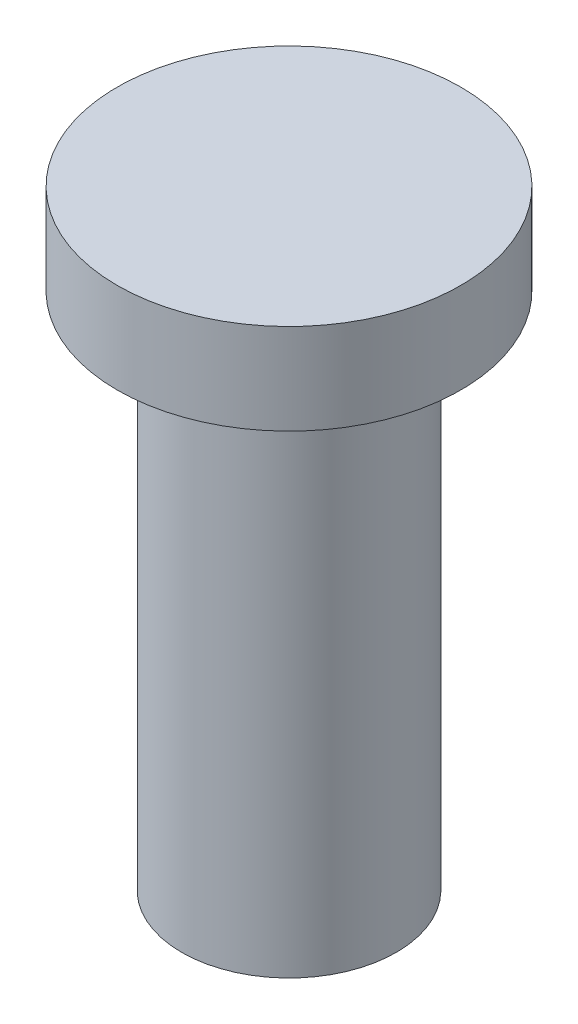
ISO-10303-21;
HEADER;
FILE_DESCRIPTION(('STEP AP214'),'2;1');
FILE_NAME('part.step','',(''),(''),'','','');
FILE_SCHEMA(('AUTOMOTIVE_DESIGN { 1 0 10303 214 1 1 1 1 }'));
ENDSEC;
DATA;
#1=APPLICATION_CONTEXT('core data for automotive mechanical design processes');
#2=APPLICATION_PROTOCOL_DEFINITION('international standard','automotive_design',2000,#1);
#3=PRODUCT_CONTEXT('',#1,'mechanical');
#4=PRODUCT('Part','Part','',(#3));
#5=PRODUCT_RELATED_PRODUCT_CATEGORY('part','',(#4));
#6=PRODUCT_DEFINITION_FORMATION('','',#4);
#7=PRODUCT_DEFINITION_CONTEXT('part definition',#1,'design');
#8=PRODUCT_DEFINITION('design','',#6,#7);
#9=PRODUCT_DEFINITION_SHAPE('','',#8);
#10=(LENGTH_UNIT() NAMED_UNIT(*) SI_UNIT(.MILLI.,.METRE.));
#11=(NAMED_UNIT(*) PLANE_ANGLE_UNIT() SI_UNIT($,.RADIAN.));
#12=(NAMED_UNIT(*) SI_UNIT($,.STERADIAN.) SOLID_ANGLE_UNIT());
#13=UNCERTAINTY_MEASURE_WITH_UNIT(LENGTH_MEASURE(1.E-05),#10,'distance_accuracy_value','');
#14=(GEOMETRIC_REPRESENTATION_CONTEXT(3) GLOBAL_UNCERTAINTY_ASSIGNED_CONTEXT((#13)) GLOBAL_UNIT_ASSIGNED_CONTEXT((#10,
#11,#12)) REPRESENTATION_CONTEXT('',''));
#15=CARTESIAN_POINT('',(0.,0.,0.));
#16=DIRECTION('',(0.,0.,1.));
#17=DIRECTION('',(1.,0.,0.));
#18=AXIS2_PLACEMENT_3D('',#15,#16,#17);
#19=CARTESIAN_POINT('',(0.,20.,0.));
#20=DIRECTION('',(0.,-1.,0.));
#21=DIRECTION('',(0.,0.,-1.));
#22=AXIS2_PLACEMENT_3D('',#19,#20,#21);
#23=CYLINDRICAL_SURFACE('',#22,3.96875);
#24=CARTESIAN_POINT('',(0.,0.,0.));
#25=DIRECTION('',(0.,1.,0.));
#26=DIRECTION('',(0.,0.,1.));
#27=AXIS2_PLACEMENT_3D('',#24,#25,#26);
#28=CIRCLE('',#27,3.96875);
#29=CARTESIAN_POINT('',(0.,0.,3.96875));
#30=VERTEX_POINT('',#29);
#31=EDGE_CURVE('E39',#30,#30,#28,.T.);
#32=ORIENTED_EDGE('',*,*,#31,.T.);
#33=EDGE_LOOP('',(#32));
#34=FACE_BOUND('',#33,.T.);
#35=CARTESIAN_POINT('',(0.,19.19,0.));
#36=DIRECTION('',(0.,1.,0.));
#37=DIRECTION('',(0.,0.,1.));
#38=AXIS2_PLACEMENT_3D('',#35,#36,#37);
#39=CIRCLE('',#38,3.96875);
#40=CARTESIAN_POINT('',(0.,19.19,3.96875));
#41=VERTEX_POINT('',#40);
#42=EDGE_CURVE('E10',#41,#41,#39,.T.);
#43=ORIENTED_EDGE('',*,*,#42,.F.);
#44=EDGE_LOOP('',(#43));
#45=FACE_BOUND('',#44,.T.);
#46=ADVANCED_FACE('F33',(#34,#45),#23,.T.);
#47=CARTESIAN_POINT('',(0.,0.,0.));
#48=DIRECTION('',(0.,1.,0.));
#49=DIRECTION('',(0.,0.,1.));
#50=AXIS2_PLACEMENT_3D('',#47,#48,#49);
#51=PLANE('',#50);
#52=CARTESIAN_POINT('',(0.,0.,0.));
#53=DIRECTION('',(0.,-1.,0.));
#54=DIRECTION('',(0.,0.,-1.));
#55=AXIS2_PLACEMENT_3D('',#52,#53,#54);
#56=CIRCLE('',#55,1.675);
#57=CARTESIAN_POINT('',(0.,0.,-1.675));
#58=VERTEX_POINT('',#57);
#59=EDGE_CURVE('E47',#58,#58,#56,.T.);
#60=ORIENTED_EDGE('',*,*,#59,.F.);
#61=EDGE_LOOP('',(#60));
#62=FACE_BOUND('',#61,.T.);
#63=ORIENTED_EDGE('',*,*,#31,.F.);
#64=EDGE_LOOP('',(#63));
#65=FACE_BOUND('',#64,.T.);
#66=ADVANCED_FACE('F76',(#62,#65),#51,.F.);
#67=CARTESIAN_POINT('',(0.,12.,0.));
#68=DIRECTION('',(0.,-1.,0.));
#69=DIRECTION('',(0.,0.,-1.));
#70=AXIS2_PLACEMENT_3D('',#67,#68,#69);
#71=CYLINDRICAL_SURFACE('',#70,1.675);
#72=CARTESIAN_POINT('',(0.,12.,0.));
#73=DIRECTION('',(0.,-1.,0.));
#74=DIRECTION('',(0.,0.,-1.));
#75=AXIS2_PLACEMENT_3D('',#72,#73,#74);
#76=CIRCLE('',#75,1.675);
#77=CARTESIAN_POINT('',(0.,12.,-1.675));
#78=VERTEX_POINT('',#77);
#79=EDGE_CURVE('E43',#78,#78,#76,.T.);
#80=ORIENTED_EDGE('',*,*,#79,.F.);
#81=EDGE_LOOP('',(#80));
#82=FACE_BOUND('',#81,.T.);
#83=ORIENTED_EDGE('',*,*,#59,.T.);
#84=EDGE_LOOP('',(#83));
#85=FACE_BOUND('',#84,.T.);
#86=ADVANCED_FACE('F72',(#82,#85),#71,.F.);
#87=CARTESIAN_POINT('',(0.,12.,0.));
#88=DIRECTION('',(0.,-1.,0.));
#89=DIRECTION('',(0.,0.,-1.));
#90=AXIS2_PLACEMENT_3D('',#87,#88,#89);
#91=PLANE('',#90);
#92=ORIENTED_EDGE('',*,*,#79,.T.);
#93=EDGE_LOOP('',(#92));
#94=FACE_BOUND('',#93,.T.);
#95=ADVANCED_FACE('F64',(#94),#91,.T.);
#96=CARTESIAN_POINT('',(0.,19.19,0.));
#97=DIRECTION('',(0.,1.,0.));
#98=DIRECTION('',(0.,0.,1.));
#99=AXIS2_PLACEMENT_3D('',#96,#97,#98);
#100=PLANE('',#99);
#101=CARTESIAN_POINT('',(0.,19.19,0.));
#102=DIRECTION('',(0.,1.,0.));
#103=DIRECTION('',(0.,0.,1.));
#104=AXIS2_PLACEMENT_3D('',#101,#102,#103);
#105=CIRCLE('',#104,6.35);
#106=CARTESIAN_POINT('',(0.,19.19,6.35));
#107=VERTEX_POINT('',#106);
#108=EDGE_CURVE('E55',#107,#107,#105,.T.);
#109=ORIENTED_EDGE('',*,*,#108,.F.);
#110=EDGE_LOOP('',(#109));
#111=FACE_BOUND('',#110,.T.);
#112=ORIENTED_EDGE('',*,*,#42,.T.);
#113=EDGE_LOOP('',(#112));
#114=FACE_BOUND('',#113,.T.);
#115=ADVANCED_FACE('F61',(#111,#114),#100,.F.);
#116=CARTESIAN_POINT('',(0.,22.54,0.));
#117=DIRECTION('',(0.,1.,0.));
#118=DIRECTION('',(0.,0.,1.));
#119=AXIS2_PLACEMENT_3D('',#116,#117,#118);
#120=PLANE('',#119);
#121=CARTESIAN_POINT('',(0.,22.54,0.));
#122=DIRECTION('',(0.,1.,0.));
#123=DIRECTION('',(0.,0.,1.));
#124=AXIS2_PLACEMENT_3D('',#121,#122,#123);
#125=CIRCLE('',#124,6.35);
#126=CARTESIAN_POINT('',(0.,22.54,6.35));
#127=VERTEX_POINT('',#126);
#128=EDGE_CURVE('E51',#127,#127,#125,.T.);
#129=ORIENTED_EDGE('',*,*,#128,.T.);
#130=EDGE_LOOP('',(#129));
#131=FACE_BOUND('',#130,.T.);
#132=ADVANCED_FACE('F63',(#131),#120,.T.);
#133=CARTESIAN_POINT('',(0.,22.54,0.));
#134=DIRECTION('',(0.,-1.,0.));
#135=DIRECTION('',(0.,0.,-1.));
#136=AXIS2_PLACEMENT_3D('',#133,#134,#135);
#137=CYLINDRICAL_SURFACE('',#136,6.35);
#138=ORIENTED_EDGE('',*,*,#128,.F.);
#139=EDGE_LOOP('',(#138));
#140=FACE_BOUND('',#139,.T.);
#141=ORIENTED_EDGE('',*,*,#108,.T.);
#142=EDGE_LOOP('',(#141));
#143=FACE_BOUND('',#142,.T.);
#144=ADVANCED_FACE('F59',(#140,#143),#137,.T.);
#145=CLOSED_SHELL('',(#46,#66,#86,#95,#115,#132,#144));
#146=MANIFOLD_SOLID_BREP('B2',#145);
#147=ADVANCED_BREP_SHAPE_REPRESENTATION('',(#18,#146),#14);
#148=SHAPE_DEFINITION_REPRESENTATION(#9,#147);
ENDSEC;
END-ISO-10303-21;
